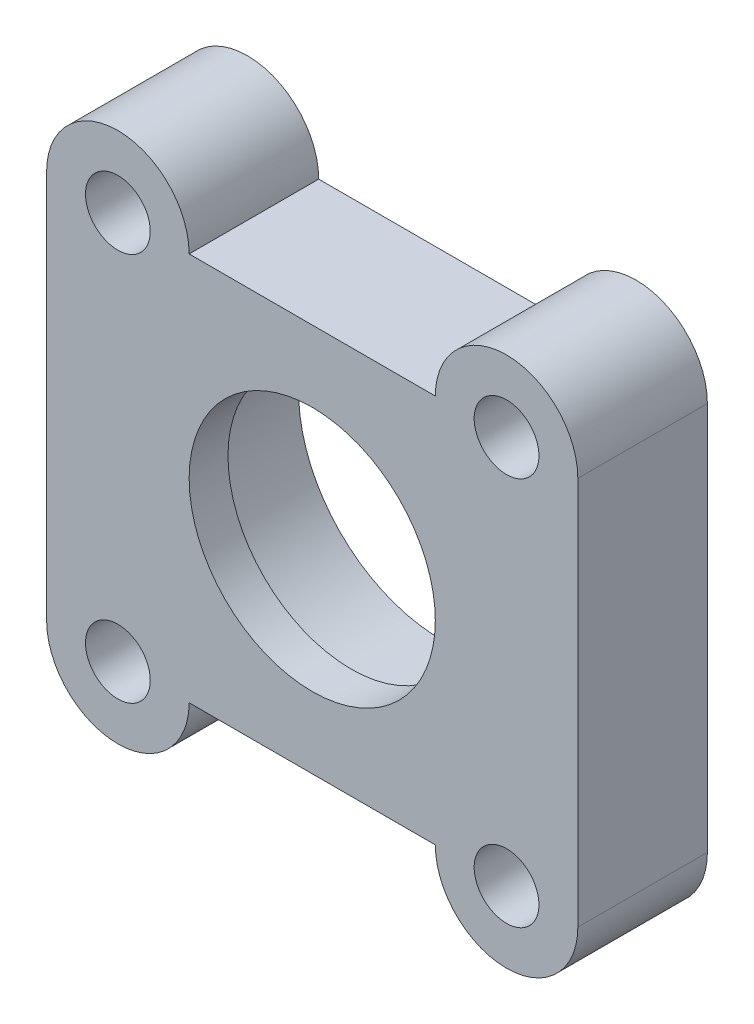
ISO-10303-21;
HEADER;
FILE_DESCRIPTION(('STEP AP214'),'2;1');
FILE_NAME('part.step','',(''),(''),'','','');
FILE_SCHEMA(('AUTOMOTIVE_DESIGN { 1 0 10303 214 1 1 1 1 }'));
ENDSEC;
DATA;
#1=APPLICATION_CONTEXT('core data for automotive mechanical design processes');
#2=APPLICATION_PROTOCOL_DEFINITION('international standard','automotive_design',2000,#1);
#3=PRODUCT_CONTEXT('',#1,'mechanical');
#4=PRODUCT('Part','Part','',(#3));
#5=PRODUCT_RELATED_PRODUCT_CATEGORY('part','',(#4));
#6=PRODUCT_DEFINITION_FORMATION('','',#4);
#7=PRODUCT_DEFINITION_CONTEXT('part definition',#1,'design');
#8=PRODUCT_DEFINITION('design','',#6,#7);
#9=PRODUCT_DEFINITION_SHAPE('','',#8);
#10=(LENGTH_UNIT() NAMED_UNIT(*) SI_UNIT(.MILLI.,.METRE.));
#11=(NAMED_UNIT(*) PLANE_ANGLE_UNIT() SI_UNIT($,.RADIAN.));
#12=(NAMED_UNIT(*) SI_UNIT($,.STERADIAN.) SOLID_ANGLE_UNIT());
#13=UNCERTAINTY_MEASURE_WITH_UNIT(LENGTH_MEASURE(1.E-05),#10,'distance_accuracy_value','');
#14=(GEOMETRIC_REPRESENTATION_CONTEXT(3) GLOBAL_UNCERTAINTY_ASSIGNED_CONTEXT((#13)) GLOBAL_UNIT_ASSIGNED_CONTEXT((#10,
#11,#12)) REPRESENTATION_CONTEXT('',''));
#15=CARTESIAN_POINT('',(0.,0.,0.));
#16=DIRECTION('',(0.,0.,1.));
#17=DIRECTION('',(1.,0.,0.));
#18=AXIS2_PLACEMENT_3D('',#15,#16,#17);
#19=CARTESIAN_POINT('',(-37.3783911926846,15.0743296636187,10.));
#20=DIRECTION('',(0.,0.,-1.));
#21=DIRECTION('',(-1.,0.,0.));
#22=AXIS2_PLACEMENT_3D('',#19,#20,#21);
#23=CYLINDRICAL_SURFACE('',#22,11.05);
#24=CARTESIAN_POINT('',(-37.3783911926846,15.0743296636187,0.));
#25=DIRECTION('',(0.,0.,1.));
#26=DIRECTION('',(1.,0.,0.));
#27=AXIS2_PLACEMENT_3D('',#24,#25,#26);
#28=CIRCLE('',#27,11.05);
#29=CARTESIAN_POINT('',(-26.3283911926846,15.0743296636187,0.));
#30=VERTEX_POINT('',#29);
#31=EDGE_CURVE('E139',#30,#30,#28,.T.);
#32=ORIENTED_EDGE('',*,*,#31,.F.);
#33=EDGE_LOOP('',(#32));
#34=FACE_BOUND('',#33,.T.);
#35=CARTESIAN_POINT('',(-37.3783911926846,15.0743296636187,7.));
#36=DIRECTION('',(0.,0.,1.));
#37=DIRECTION('',(1.,0.,0.));
#38=AXIS2_PLACEMENT_3D('',#35,#36,#37);
#39=CIRCLE('',#38,11.05);
#40=CARTESIAN_POINT('',(-26.3283911926846,15.0743296636187,7.));
#41=VERTEX_POINT('',#40);
#42=EDGE_CURVE('E40',#41,#41,#39,.T.);
#43=ORIENTED_EDGE('',*,*,#42,.T.);
#44=EDGE_LOOP('',(#43));
#45=FACE_BOUND('',#44,.T.);
#46=ADVANCED_FACE('F36',(#34,#45),#23,.F.);
#47=CARTESIAN_POINT('',(-52.3783911926845,30.0743296636187,10.));
#48=DIRECTION('',(0.,0.,-1.));
#49=DIRECTION('',(-1.,0.,0.));
#50=AXIS2_PLACEMENT_3D('',#47,#48,#49);
#51=PLANE('',#50);
#52=CARTESIAN_POINT('',(-52.3783911926845,30.0743296636187,10.));
#53=DIRECTION('',(0.,0.,1.));
#54=DIRECTION('',(-1.,0.,0.));
#55=AXIS2_PLACEMENT_3D('',#52,#53,#54);
#56=CIRCLE('',#55,5.5);
#57=CARTESIAN_POINT('',(-46.8783911926846,30.0743296636187,10.));
#58=VERTEX_POINT('',#57);
#59=CARTESIAN_POINT('',(-57.8783911926846,30.0743296636187,10.));
#60=VERTEX_POINT('',#59);
#61=EDGE_CURVE('E150',#58,#60,#56,.T.);
#62=ORIENTED_EDGE('',*,*,#61,.T.);
#63=DIRECTION('',(0.,-1.,0.));
#64=VECTOR('',#63,1.);
#65=CARTESIAN_POINT('',(-57.8783911926846,30.0743296636187,10.));
#66=LINE('',#65,#64);
#67=CARTESIAN_POINT('',(-57.8783911926846,0.0743296636185652,10.));
#68=VERTEX_POINT('',#67);
#69=EDGE_CURVE('E97',#60,#68,#66,.T.);
#70=ORIENTED_EDGE('',*,*,#69,.T.);
#71=CARTESIAN_POINT('',(-52.3783911926845,0.0743296636186996,10.));
#72=DIRECTION('',(0.,0.,1.));
#73=DIRECTION('',(1.,0.,0.));
#74=AXIS2_PLACEMENT_3D('',#71,#72,#73);
#75=CIRCLE('',#74,5.5);
#76=CARTESIAN_POINT('',(-46.8783911926845,0.0743296636186996,10.));
#77=VERTEX_POINT('',#76);
#78=EDGE_CURVE('E166',#68,#77,#75,.T.);
#79=ORIENTED_EDGE('',*,*,#78,.T.);
#80=DIRECTION('',(1.,0.,0.));
#81=VECTOR('',#80,1.);
#82=CARTESIAN_POINT('',(-27.8783911926845,0.0743296636187551,10.));
#83=LINE('',#82,#81);
#84=CARTESIAN_POINT('',(-27.8783911926845,0.0743296636187551,10.));
#85=VERTEX_POINT('',#84);
#86=EDGE_CURVE('E179',#77,#85,#83,.T.);
#87=ORIENTED_EDGE('',*,*,#86,.T.);
#88=CARTESIAN_POINT('',(-22.3783911926845,0.0743296636186996,10.));
#89=DIRECTION('',(0.,0.,1.));
#90=DIRECTION('',(-1.,0.,0.));
#91=AXIS2_PLACEMENT_3D('',#88,#89,#90);
#92=CIRCLE('',#91,5.50000000000006);
#93=CARTESIAN_POINT('',(-16.8783911926845,0.074329663618566,10.));
#94=VERTEX_POINT('',#93);
#95=EDGE_CURVE('E117',#85,#94,#92,.T.);
#96=ORIENTED_EDGE('',*,*,#95,.T.);
#97=DIRECTION('',(0.,1.,0.));
#98=VECTOR('',#97,1.);
#99=CARTESIAN_POINT('',(-16.8783911926845,30.0743296636187,10.));
#100=LINE('',#99,#98);
#101=CARTESIAN_POINT('',(-16.8783911926845,30.0743296636187,10.));
#102=VERTEX_POINT('',#101);
#103=EDGE_CURVE('E110',#94,#102,#100,.T.);
#104=ORIENTED_EDGE('',*,*,#103,.T.);
#105=CARTESIAN_POINT('',(-22.3783911926845,30.0743296636187,10.));
#106=DIRECTION('',(0.,0.,1.));
#107=DIRECTION('',(1.,0.,0.));
#108=AXIS2_PLACEMENT_3D('',#105,#106,#107);
#109=CIRCLE('',#108,5.5);
#110=CARTESIAN_POINT('',(-27.8783911926845,30.0743296636187,10.));
#111=VERTEX_POINT('',#110);
#112=EDGE_CURVE('E115',#102,#111,#109,.T.);
#113=ORIENTED_EDGE('',*,*,#112,.T.);
#114=DIRECTION('',(-1.,0.,0.));
#115=VECTOR('',#114,1.);
#116=CARTESIAN_POINT('',(-27.8783911926845,30.0743296636187,10.));
#117=LINE('',#116,#115);
#118=EDGE_CURVE('E54',#111,#58,#117,.T.);
#119=ORIENTED_EDGE('',*,*,#118,.T.);
#120=EDGE_LOOP('',(#62,#70,#79,#87,#96,#104,#113,#119));
#121=FACE_BOUND('',#120,.T.);
#122=CARTESIAN_POINT('',(-22.3783911926845,0.0743296636186996,10.));
#123=DIRECTION('',(0.,0.,1.));
#124=DIRECTION('',(1.,0.,0.));
#125=AXIS2_PLACEMENT_3D('',#122,#123,#124);
#126=CIRCLE('',#125,2.5);
#127=CARTESIAN_POINT('',(-19.8783911926845,0.0743296636186996,10.));
#128=VERTEX_POINT('',#127);
#129=EDGE_CURVE('E187',#128,#128,#126,.T.);
#130=ORIENTED_EDGE('',*,*,#129,.F.);
#131=EDGE_LOOP('',(#130));
#132=FACE_BOUND('',#131,.T.);
#133=CARTESIAN_POINT('',(-52.3783911926845,0.0743296636186996,10.));
#134=DIRECTION('',(0.,0.,1.));
#135=DIRECTION('',(1.,0.,0.));
#136=AXIS2_PLACEMENT_3D('',#133,#134,#135);
#137=CIRCLE('',#136,2.5);
#138=CARTESIAN_POINT('',(-49.8783911926845,0.0743296636186996,10.));
#139=VERTEX_POINT('',#138);
#140=EDGE_CURVE('E191',#139,#139,#137,.T.);
#141=ORIENTED_EDGE('',*,*,#140,.F.);
#142=EDGE_LOOP('',(#141));
#143=FACE_BOUND('',#142,.T.);
#144=CARTESIAN_POINT('',(-52.3783911926845,30.0743296636187,10.));
#145=DIRECTION('',(0.,0.,1.));
#146=DIRECTION('',(1.,0.,0.));
#147=AXIS2_PLACEMENT_3D('',#144,#145,#146);
#148=CIRCLE('',#147,2.5);
#149=CARTESIAN_POINT('',(-49.8783911926845,30.0743296636187,10.));
#150=VERTEX_POINT('',#149);
#151=EDGE_CURVE('E197',#150,#150,#148,.T.);
#152=ORIENTED_EDGE('',*,*,#151,.F.);
#153=EDGE_LOOP('',(#152));
#154=FACE_BOUND('',#153,.T.);
#155=CARTESIAN_POINT('',(-22.3783911926845,30.0743296636187,10.));
#156=DIRECTION('',(0.,0.,1.));
#157=DIRECTION('',(1.,0.,0.));
#158=AXIS2_PLACEMENT_3D('',#155,#156,#157);
#159=CIRCLE('',#158,2.5);
#160=CARTESIAN_POINT('',(-19.8783911926845,30.0743296636187,10.));
#161=VERTEX_POINT('',#160);
#162=EDGE_CURVE('E203',#161,#161,#159,.T.);
#163=ORIENTED_EDGE('',*,*,#162,.F.);
#164=EDGE_LOOP('',(#163));
#165=FACE_BOUND('',#164,.T.);
#166=CARTESIAN_POINT('',(-37.3783911926846,15.0743296636187,10.));
#167=DIRECTION('',(0.,0.,1.));
#168=DIRECTION('',(1.,0.,0.));
#169=AXIS2_PLACEMENT_3D('',#166,#167,#168);
#170=CIRCLE('',#169,9.5);
#171=CARTESIAN_POINT('',(-27.8783911926846,15.0743296636187,10.));
#172=VERTEX_POINT('',#171);
#173=EDGE_CURVE('E211',#172,#172,#170,.T.);
#174=ORIENTED_EDGE('',*,*,#173,.F.);
#175=EDGE_LOOP('',(#174));
#176=FACE_BOUND('',#175,.T.);
#177=ADVANCED_FACE('F112',(#121,#132,#143,#154,#165,#176),#51,.F.);
#178=CARTESIAN_POINT('',(-52.3783911926845,30.0743296636187,0.));
#179=DIRECTION('',(0.,0.,-1.));
#180=DIRECTION('',(-1.,0.,0.));
#181=AXIS2_PLACEMENT_3D('',#178,#179,#180);
#182=PLANE('',#181);
#183=CARTESIAN_POINT('',(-52.3783911926845,30.0743296636187,0.));
#184=DIRECTION('',(0.,0.,1.));
#185=DIRECTION('',(1.,0.,0.));
#186=AXIS2_PLACEMENT_3D('',#183,#184,#185);
#187=CIRCLE('',#186,2.5);
#188=CARTESIAN_POINT('',(-49.8783911926845,30.0743296636187,0.));
#189=VERTEX_POINT('',#188);
#190=EDGE_CURVE('E200',#189,#189,#187,.T.);
#191=ORIENTED_EDGE('',*,*,#190,.T.);
#192=EDGE_LOOP('',(#191));
#193=FACE_BOUND('',#192,.T.);
#194=CARTESIAN_POINT('',(-22.3783911926845,0.0743296636186996,0.));
#195=DIRECTION('',(0.,0.,1.));
#196=DIRECTION('',(1.,0.,0.));
#197=AXIS2_PLACEMENT_3D('',#194,#195,#196);
#198=CIRCLE('',#197,2.5);
#199=CARTESIAN_POINT('',(-19.8783911926845,0.0743296636186996,0.));
#200=VERTEX_POINT('',#199);
#201=EDGE_CURVE('E188',#200,#200,#198,.T.);
#202=ORIENTED_EDGE('',*,*,#201,.T.);
#203=EDGE_LOOP('',(#202));
#204=FACE_BOUND('',#203,.T.);
#205=CARTESIAN_POINT('',(-52.3783911926845,30.0743296636187,0.));
#206=DIRECTION('',(0.,0.,1.));
#207=DIRECTION('',(-1.,0.,0.));
#208=AXIS2_PLACEMENT_3D('',#205,#206,#207);
#209=CIRCLE('',#208,5.5);
#210=CARTESIAN_POINT('',(-46.8783911926846,30.0743296636187,0.));
#211=VERTEX_POINT('',#210);
#212=CARTESIAN_POINT('',(-57.8783911926846,30.0743296636187,0.));
#213=VERTEX_POINT('',#212);
#214=EDGE_CURVE('E135',#211,#213,#209,.T.);
#215=ORIENTED_EDGE('',*,*,#214,.F.);
#216=DIRECTION('',(-1.,0.,0.));
#217=VECTOR('',#216,1.);
#218=CARTESIAN_POINT('',(-27.8783911926845,30.0743296636187,0.));
#219=LINE('',#218,#217);
#220=CARTESIAN_POINT('',(-27.8783911926845,30.0743296636187,0.));
#221=VERTEX_POINT('',#220);
#222=EDGE_CURVE('E89',#221,#211,#219,.T.);
#223=ORIENTED_EDGE('',*,*,#222,.F.);
#224=CARTESIAN_POINT('',(-22.3783911926845,30.0743296636187,0.));
#225=DIRECTION('',(0.,0.,1.));
#226=DIRECTION('',(1.,0.,0.));
#227=AXIS2_PLACEMENT_3D('',#224,#225,#226);
#228=CIRCLE('',#227,5.5);
#229=CARTESIAN_POINT('',(-16.8783911926845,30.0743296636187,0.));
#230=VERTEX_POINT('',#229);
#231=EDGE_CURVE('E83',#230,#221,#228,.T.);
#232=ORIENTED_EDGE('',*,*,#231,.F.);
#233=DIRECTION('',(0.,1.,0.));
#234=VECTOR('',#233,1.);
#235=CARTESIAN_POINT('',(-16.8783911926845,30.0743296636187,0.));
#236=LINE('',#235,#234);
#237=CARTESIAN_POINT('',(-16.8783911926845,0.074329663618566,0.));
#238=VERTEX_POINT('',#237);
#239=EDGE_CURVE('E125',#238,#230,#236,.T.);
#240=ORIENTED_EDGE('',*,*,#239,.F.);
#241=CARTESIAN_POINT('',(-22.3783911926845,0.0743296636186996,0.));
#242=DIRECTION('',(0.,0.,1.));
#243=DIRECTION('',(-1.,0.,0.));
#244=AXIS2_PLACEMENT_3D('',#241,#242,#243);
#245=CIRCLE('',#244,5.50000000000006);
#246=CARTESIAN_POINT('',(-27.8783911926845,0.0743296636187551,0.));
#247=VERTEX_POINT('',#246);
#248=EDGE_CURVE('E145',#247,#238,#245,.T.);
#249=ORIENTED_EDGE('',*,*,#248,.F.);
#250=DIRECTION('',(1.,0.,0.));
#251=VECTOR('',#250,1.);
#252=CARTESIAN_POINT('',(-27.8783911926845,0.0743296636187551,0.));
#253=LINE('',#252,#251);
#254=CARTESIAN_POINT('',(-46.8783911926845,0.0743296636186996,0.));
#255=VERTEX_POINT('',#254);
#256=EDGE_CURVE('E143',#255,#247,#253,.T.);
#257=ORIENTED_EDGE('',*,*,#256,.F.);
#258=CARTESIAN_POINT('',(-52.3783911926845,0.0743296636186996,0.));
#259=DIRECTION('',(0.,0.,1.));
#260=DIRECTION('',(1.,0.,0.));
#261=AXIS2_PLACEMENT_3D('',#258,#259,#260);
#262=CIRCLE('',#261,5.5);
#263=CARTESIAN_POINT('',(-57.8783911926846,0.0743296636185652,0.));
#264=VERTEX_POINT('',#263);
#265=EDGE_CURVE('E141',#264,#255,#262,.T.);
#266=ORIENTED_EDGE('',*,*,#265,.F.);
#267=DIRECTION('',(0.,-1.,0.));
#268=VECTOR('',#267,1.);
#269=CARTESIAN_POINT('',(-57.8783911926846,30.0743296636187,0.));
#270=LINE('',#269,#268);
#271=EDGE_CURVE('E138',#213,#264,#270,.T.);
#272=ORIENTED_EDGE('',*,*,#271,.F.);
#273=EDGE_LOOP('',(#215,#223,#232,#240,#249,#257,#266,#272));
#274=FACE_BOUND('',#273,.T.);
#275=ORIENTED_EDGE('',*,*,#31,.T.);
#276=EDGE_LOOP('',(#275));
#277=FACE_BOUND('',#276,.T.);
#278=CARTESIAN_POINT('',(-52.3783911926845,0.0743296636186996,0.));
#279=DIRECTION('',(0.,0.,1.));
#280=DIRECTION('',(1.,0.,0.));
#281=AXIS2_PLACEMENT_3D('',#278,#279,#280);
#282=CIRCLE('',#281,2.5);
#283=CARTESIAN_POINT('',(-49.8783911926845,0.0743296636186996,0.));
#284=VERTEX_POINT('',#283);
#285=EDGE_CURVE('E194',#284,#284,#282,.T.);
#286=ORIENTED_EDGE('',*,*,#285,.T.);
#287=EDGE_LOOP('',(#286));
#288=FACE_BOUND('',#287,.T.);
#289=CARTESIAN_POINT('',(-22.3783911926845,30.0743296636187,0.));
#290=DIRECTION('',(0.,0.,1.));
#291=DIRECTION('',(1.,0.,0.));
#292=AXIS2_PLACEMENT_3D('',#289,#290,#291);
#293=CIRCLE('',#292,2.5);
#294=CARTESIAN_POINT('',(-19.8783911926845,30.0743296636187,0.));
#295=VERTEX_POINT('',#294);
#296=EDGE_CURVE('E206',#295,#295,#293,.T.);
#297=ORIENTED_EDGE('',*,*,#296,.T.);
#298=EDGE_LOOP('',(#297));
#299=FACE_BOUND('',#298,.T.);
#300=ADVANCED_FACE('F170',(#193,#204,#274,#277,#288,#299),#182,.T.);
#301=CARTESIAN_POINT('',(-52.3783911926845,30.0743296636187,10.));
#302=DIRECTION('',(0.,0.,-1.));
#303=DIRECTION('',(-1.,0.,0.));
#304=AXIS2_PLACEMENT_3D('',#301,#302,#303);
#305=CYLINDRICAL_SURFACE('',#304,5.5);
#306=ORIENTED_EDGE('',*,*,#214,.T.);
#307=DIRECTION('',(0.,0.,-1.));
#308=VECTOR('',#307,1.);
#309=CARTESIAN_POINT('',(-57.8783911926846,30.0743296636187,10.));
#310=LINE('',#309,#308);
#311=EDGE_CURVE('E11',#60,#213,#310,.T.);
#312=ORIENTED_EDGE('',*,*,#311,.F.);
#313=ORIENTED_EDGE('',*,*,#61,.F.);
#314=DIRECTION('',(0.,0.,-1.));
#315=VECTOR('',#314,1.);
#316=CARTESIAN_POINT('',(-46.8783911926846,30.0743296636187,10.));
#317=LINE('',#316,#315);
#318=EDGE_CURVE('E131',#58,#211,#317,.T.);
#319=ORIENTED_EDGE('',*,*,#318,.T.);
#320=EDGE_LOOP('',(#306,#312,#313,#319));
#321=FACE_BOUND('',#320,.T.);
#322=ADVANCED_FACE('F38',(#321),#305,.T.);
#323=CARTESIAN_POINT('',(-57.8783911926846,30.0743296636187,10.));
#324=DIRECTION('',(1.,0.,0.));
#325=DIRECTION('',(0.,0.,-1.));
#326=AXIS2_PLACEMENT_3D('',#323,#324,#325);
#327=PLANE('',#326);
#328=ORIENTED_EDGE('',*,*,#271,.T.);
#329=DIRECTION('',(0.,0.,-1.));
#330=VECTOR('',#329,1.);
#331=CARTESIAN_POINT('',(-57.8783911926846,0.0743296636185652,10.));
#332=LINE('',#331,#330);
#333=EDGE_CURVE('E46',#68,#264,#332,.T.);
#334=ORIENTED_EDGE('',*,*,#333,.F.);
#335=ORIENTED_EDGE('',*,*,#69,.F.);
#336=ORIENTED_EDGE('',*,*,#311,.T.);
#337=EDGE_LOOP('',(#328,#334,#335,#336));
#338=FACE_BOUND('',#337,.T.);
#339=ADVANCED_FACE('F263',(#338),#327,.F.);
#340=CARTESIAN_POINT('',(-52.3783911926845,0.0743296636186996,10.));
#341=DIRECTION('',(0.,0.,-1.));
#342=DIRECTION('',(-1.,0.,0.));
#343=AXIS2_PLACEMENT_3D('',#340,#341,#342);
#344=CYLINDRICAL_SURFACE('',#343,5.5);
#345=ORIENTED_EDGE('',*,*,#265,.T.);
#346=DIRECTION('',(0.,0.,-1.));
#347=VECTOR('',#346,1.);
#348=CARTESIAN_POINT('',(-46.8783911926845,0.0743296636186996,10.));
#349=LINE('',#348,#347);
#350=EDGE_CURVE('E157',#77,#255,#349,.T.);
#351=ORIENTED_EDGE('',*,*,#350,.F.);
#352=ORIENTED_EDGE('',*,*,#78,.F.);
#353=ORIENTED_EDGE('',*,*,#333,.T.);
#354=EDGE_LOOP('',(#345,#351,#352,#353));
#355=FACE_BOUND('',#354,.T.);
#356=ADVANCED_FACE('F164',(#355),#344,.T.);
#357=CARTESIAN_POINT('',(-27.8783911926845,0.0743296636187551,10.));
#358=DIRECTION('',(0.,1.,0.));
#359=DIRECTION('',(0.,0.,1.));
#360=AXIS2_PLACEMENT_3D('',#357,#358,#359);
#361=PLANE('',#360);
#362=ORIENTED_EDGE('',*,*,#256,.T.);
#363=DIRECTION('',(0.,0.,-1.));
#364=VECTOR('',#363,1.);
#365=CARTESIAN_POINT('',(-27.8783911926845,0.0743296636187551,10.));
#366=LINE('',#365,#364);
#367=EDGE_CURVE('E154',#85,#247,#366,.T.);
#368=ORIENTED_EDGE('',*,*,#367,.F.);
#369=ORIENTED_EDGE('',*,*,#86,.F.);
#370=ORIENTED_EDGE('',*,*,#350,.T.);
#371=EDGE_LOOP('',(#362,#368,#369,#370));
#372=FACE_BOUND('',#371,.T.);
#373=ADVANCED_FACE('F175',(#372),#361,.F.);
#374=CARTESIAN_POINT('',(-22.3783911926845,0.0743296636186996,10.));
#375=DIRECTION('',(0.,0.,-1.));
#376=DIRECTION('',(-1.,0.,0.));
#377=AXIS2_PLACEMENT_3D('',#374,#375,#376);
#378=CYLINDRICAL_SURFACE('',#377,5.50000000000006);
#379=ORIENTED_EDGE('',*,*,#248,.T.);
#380=DIRECTION('',(0.,0.,-1.));
#381=VECTOR('',#380,1.);
#382=CARTESIAN_POINT('',(-16.8783911926845,0.074329663618566,10.));
#383=LINE('',#382,#381);
#384=EDGE_CURVE('E126',#94,#238,#383,.T.);
#385=ORIENTED_EDGE('',*,*,#384,.F.);
#386=ORIENTED_EDGE('',*,*,#95,.F.);
#387=ORIENTED_EDGE('',*,*,#367,.T.);
#388=EDGE_LOOP('',(#379,#385,#386,#387));
#389=FACE_BOUND('',#388,.T.);
#390=ADVANCED_FACE('F178',(#389),#378,.T.);
#391=CARTESIAN_POINT('',(-16.8783911926845,30.0743296636187,10.));
#392=DIRECTION('',(-1.,0.,0.));
#393=DIRECTION('',(0.,-1.,0.));
#394=AXIS2_PLACEMENT_3D('',#391,#392,#393);
#395=PLANE('',#394);
#396=ORIENTED_EDGE('',*,*,#239,.T.);
#397=DIRECTION('',(0.,0.,-1.));
#398=VECTOR('',#397,1.);
#399=CARTESIAN_POINT('',(-16.8783911926845,30.0743296636187,10.));
#400=LINE('',#399,#398);
#401=EDGE_CURVE('E122',#102,#230,#400,.T.);
#402=ORIENTED_EDGE('',*,*,#401,.F.);
#403=ORIENTED_EDGE('',*,*,#103,.F.);
#404=ORIENTED_EDGE('',*,*,#384,.T.);
#405=EDGE_LOOP('',(#396,#402,#403,#404));
#406=FACE_BOUND('',#405,.T.);
#407=ADVANCED_FACE('F123',(#406),#395,.F.);
#408=CARTESIAN_POINT('',(-22.3783911926845,30.0743296636187,10.));
#409=DIRECTION('',(0.,0.,-1.));
#410=DIRECTION('',(-1.,0.,0.));
#411=AXIS2_PLACEMENT_3D('',#408,#409,#410);
#412=CYLINDRICAL_SURFACE('',#411,5.5);
#413=ORIENTED_EDGE('',*,*,#231,.T.);
#414=DIRECTION('',(0.,0.,-1.));
#415=VECTOR('',#414,1.);
#416=CARTESIAN_POINT('',(-27.8783911926845,30.0743296636187,10.));
#417=LINE('',#416,#415);
#418=EDGE_CURVE('E127',#111,#221,#417,.T.);
#419=ORIENTED_EDGE('',*,*,#418,.F.);
#420=ORIENTED_EDGE('',*,*,#112,.F.);
#421=ORIENTED_EDGE('',*,*,#401,.T.);
#422=EDGE_LOOP('',(#413,#419,#420,#421));
#423=FACE_BOUND('',#422,.T.);
#424=ADVANCED_FACE('F129',(#423),#412,.T.);
#425=CARTESIAN_POINT('',(-27.8783911926845,30.0743296636187,10.));
#426=DIRECTION('',(0.,-1.,0.));
#427=DIRECTION('',(0.,0.,-1.));
#428=AXIS2_PLACEMENT_3D('',#425,#426,#427);
#429=PLANE('',#428);
#430=ORIENTED_EDGE('',*,*,#222,.T.);
#431=ORIENTED_EDGE('',*,*,#318,.F.);
#432=ORIENTED_EDGE('',*,*,#118,.F.);
#433=ORIENTED_EDGE('',*,*,#418,.T.);
#434=EDGE_LOOP('',(#430,#431,#432,#433));
#435=FACE_BOUND('',#434,.T.);
#436=ADVANCED_FACE('F251',(#435),#429,.F.);
#437=CARTESIAN_POINT('',(-22.3783911926845,0.0743296636186996,10.));
#438=DIRECTION('',(0.,0.,-1.));
#439=DIRECTION('',(-1.,0.,0.));
#440=AXIS2_PLACEMENT_3D('',#437,#438,#439);
#441=CYLINDRICAL_SURFACE('',#440,2.5);
#442=ORIENTED_EDGE('',*,*,#129,.T.);
#443=EDGE_LOOP('',(#442));
#444=FACE_BOUND('',#443,.T.);
#445=ORIENTED_EDGE('',*,*,#201,.F.);
#446=EDGE_LOOP('',(#445));
#447=FACE_BOUND('',#446,.T.);
#448=ADVANCED_FACE('F245',(#444,#447),#441,.F.);
#449=CARTESIAN_POINT('',(-52.3783911926845,0.0743296636186996,10.));
#450=DIRECTION('',(0.,0.,-1.));
#451=DIRECTION('',(-1.,0.,0.));
#452=AXIS2_PLACEMENT_3D('',#449,#450,#451);
#453=CYLINDRICAL_SURFACE('',#452,2.5);
#454=ORIENTED_EDGE('',*,*,#140,.T.);
#455=EDGE_LOOP('',(#454));
#456=FACE_BOUND('',#455,.T.);
#457=ORIENTED_EDGE('',*,*,#285,.F.);
#458=EDGE_LOOP('',(#457));
#459=FACE_BOUND('',#458,.T.);
#460=ADVANCED_FACE('F311',(#456,#459),#453,.F.);
#461=CARTESIAN_POINT('',(-52.3783911926845,30.0743296636187,10.));
#462=DIRECTION('',(0.,0.,-1.));
#463=DIRECTION('',(-1.,0.,0.));
#464=AXIS2_PLACEMENT_3D('',#461,#462,#463);
#465=CYLINDRICAL_SURFACE('',#464,2.5);
#466=ORIENTED_EDGE('',*,*,#151,.T.);
#467=EDGE_LOOP('',(#466));
#468=FACE_BOUND('',#467,.T.);
#469=ORIENTED_EDGE('',*,*,#190,.F.);
#470=EDGE_LOOP('',(#469));
#471=FACE_BOUND('',#470,.T.);
#472=ADVANCED_FACE('F233',(#468,#471),#465,.F.);
#473=CARTESIAN_POINT('',(-22.3783911926845,30.0743296636187,10.));
#474=DIRECTION('',(0.,0.,-1.));
#475=DIRECTION('',(-1.,0.,0.));
#476=AXIS2_PLACEMENT_3D('',#473,#474,#475);
#477=CYLINDRICAL_SURFACE('',#476,2.5);
#478=ORIENTED_EDGE('',*,*,#162,.T.);
#479=EDGE_LOOP('',(#478));
#480=FACE_BOUND('',#479,.T.);
#481=ORIENTED_EDGE('',*,*,#296,.F.);
#482=EDGE_LOOP('',(#481));
#483=FACE_BOUND('',#482,.T.);
#484=ADVANCED_FACE('F225',(#480,#483),#477,.F.);
#485=CARTESIAN_POINT('',(-37.3783911926846,15.0743296636187,7.));
#486=DIRECTION('',(0.,0.,1.));
#487=DIRECTION('',(1.,0.,0.));
#488=AXIS2_PLACEMENT_3D('',#485,#486,#487);
#489=PLANE('',#488);
#490=CARTESIAN_POINT('',(-37.3783911926846,15.0743296636187,7.));
#491=DIRECTION('',(0.,0.,1.));
#492=DIRECTION('',(1.,0.,0.));
#493=AXIS2_PLACEMENT_3D('',#490,#491,#492);
#494=CIRCLE('',#493,9.5);
#495=CARTESIAN_POINT('',(-27.8783911926846,15.0743296636187,7.));
#496=VERTEX_POINT('',#495);
#497=EDGE_CURVE('E214',#496,#496,#494,.T.);
#498=ORIENTED_EDGE('',*,*,#497,.T.);
#499=EDGE_LOOP('',(#498));
#500=FACE_BOUND('',#499,.T.);
#501=ORIENTED_EDGE('',*,*,#42,.F.);
#502=EDGE_LOOP('',(#501));
#503=FACE_BOUND('',#502,.T.);
#504=ADVANCED_FACE('F222',(#500,#503),#489,.F.);
#505=CARTESIAN_POINT('',(-37.3783911926846,15.0743296636187,7.));
#506=DIRECTION('',(0.,0.,1.));
#507=DIRECTION('',(1.,0.,0.));
#508=AXIS2_PLACEMENT_3D('',#505,#506,#507);
#509=CYLINDRICAL_SURFACE('',#508,9.5);
#510=ORIENTED_EDGE('',*,*,#497,.F.);
#511=EDGE_LOOP('',(#510));
#512=FACE_BOUND('',#511,.T.);
#513=ORIENTED_EDGE('',*,*,#173,.T.);
#514=EDGE_LOOP('',(#513));
#515=FACE_BOUND('',#514,.T.);
#516=ADVANCED_FACE('F224',(#512,#515),#509,.F.);
#517=CLOSED_SHELL('',(#46,#177,#300,#322,#339,#356,#373,#390,#407,#424,#436,#448,#460,#472,#484,
#504,#516));
#518=MANIFOLD_SOLID_BREP('B2',#517);
#519=ADVANCED_BREP_SHAPE_REPRESENTATION('',(#18,#518),#14);
#520=SHAPE_DEFINITION_REPRESENTATION(#9,#519);
ENDSEC;
END-ISO-10303-21;
